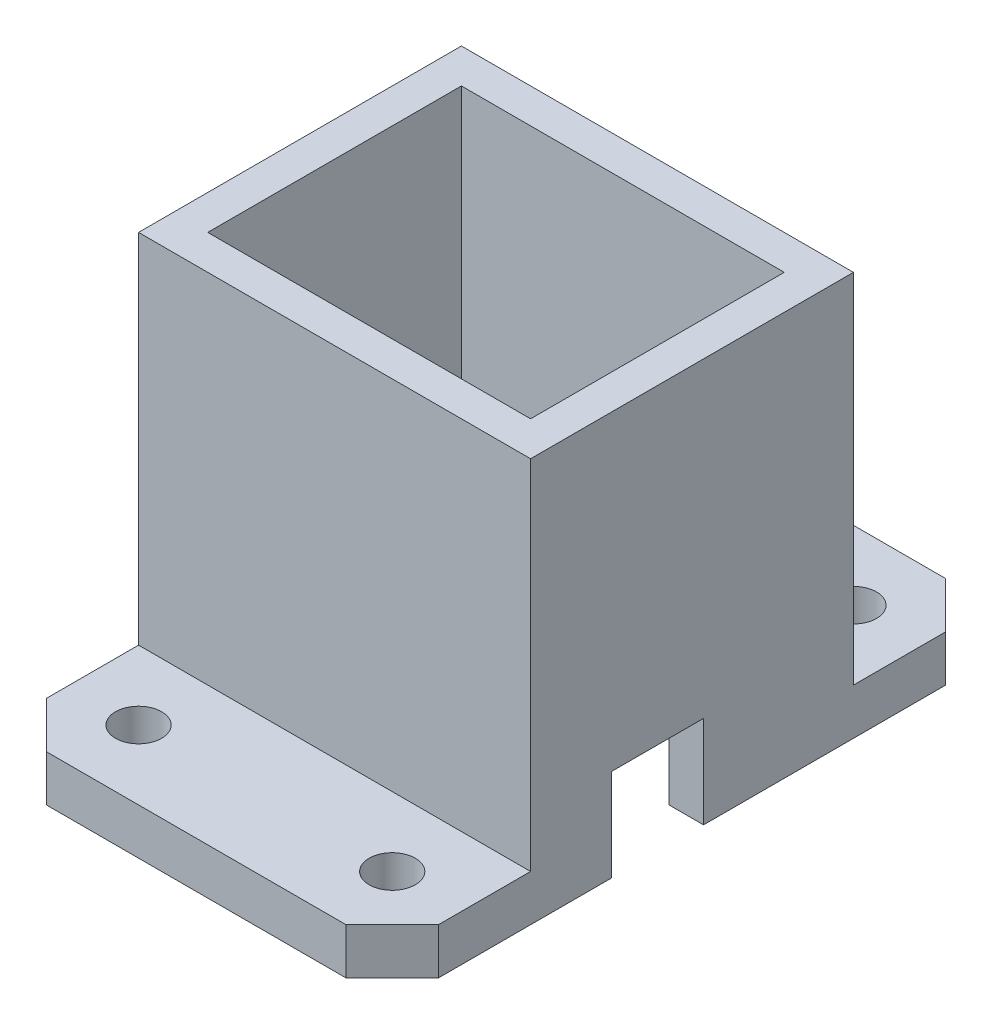
ISO-10303-21;
HEADER;
FILE_DESCRIPTION(('STEP AP214'),'2;1');
FILE_NAME('part.step','',(''),(''),'','','');
FILE_SCHEMA(('AUTOMOTIVE_DESIGN { 1 0 10303 214 1 1 1 1 }'));
ENDSEC;
DATA;
#1=APPLICATION_CONTEXT('core data for automotive mechanical design processes');
#2=APPLICATION_PROTOCOL_DEFINITION('international standard','automotive_design',2000,#1);
#3=PRODUCT_CONTEXT('',#1,'mechanical');
#4=PRODUCT('Part','Part','',(#3));
#5=PRODUCT_RELATED_PRODUCT_CATEGORY('part','',(#4));
#6=PRODUCT_DEFINITION_FORMATION('','',#4);
#7=PRODUCT_DEFINITION_CONTEXT('part definition',#1,'design');
#8=PRODUCT_DEFINITION('design','',#6,#7);
#9=PRODUCT_DEFINITION_SHAPE('','',#8);
#10=(LENGTH_UNIT() NAMED_UNIT(*) SI_UNIT(.MILLI.,.METRE.));
#11=(NAMED_UNIT(*) PLANE_ANGLE_UNIT() SI_UNIT($,.RADIAN.));
#12=(NAMED_UNIT(*) SI_UNIT($,.STERADIAN.) SOLID_ANGLE_UNIT());
#13=UNCERTAINTY_MEASURE_WITH_UNIT(LENGTH_MEASURE(1.E-05),#10,'distance_accuracy_value','');
#14=(GEOMETRIC_REPRESENTATION_CONTEXT(3) GLOBAL_UNCERTAINTY_ASSIGNED_CONTEXT((#13)) GLOBAL_UNIT_ASSIGNED_CONTEXT((#10,
#11,#12)) REPRESENTATION_CONTEXT('',''));
#15=CARTESIAN_POINT('',(0.,0.,0.));
#16=DIRECTION('',(0.,0.,1.));
#17=DIRECTION('',(1.,0.,0.));
#18=AXIS2_PLACEMENT_3D('',#15,#16,#17);
#19=CARTESIAN_POINT('',(-17.,35.,-14.));
#20=DIRECTION('',(0.,0.,1.));
#21=DIRECTION('',(1.,0.,0.));
#22=AXIS2_PLACEMENT_3D('',#19,#20,#21);
#23=PLANE('',#22);
#24=DIRECTION('',(1.,0.,0.));
#25=VECTOR('',#24,1.);
#26=CARTESIAN_POINT('',(17.,4.,-14.));
#27=LINE('',#26,#25);
#28=CARTESIAN_POINT('',(-17.,4.,-14.));
#29=VERTEX_POINT('',#28);
#30=CARTESIAN_POINT('',(17.,4.,-14.));
#31=VERTEX_POINT('',#30);
#32=EDGE_CURVE('E205',#29,#31,#27,.T.);
#33=ORIENTED_EDGE('',*,*,#32,.F.);
#34=DIRECTION('',(0.,-1.,0.));
#35=VECTOR('',#34,1.);
#36=CARTESIAN_POINT('',(-17.,35.,-14.));
#37=LINE('',#36,#35);
#38=CARTESIAN_POINT('',(-17.,35.,-14.));
#39=VERTEX_POINT('',#38);
#40=EDGE_CURVE('E210',#39,#29,#37,.T.);
#41=ORIENTED_EDGE('',*,*,#40,.F.);
#42=DIRECTION('',(-1.,0.,0.));
#43=VECTOR('',#42,1.);
#44=CARTESIAN_POINT('',(-17.,35.,-14.));
#45=LINE('',#44,#43);
#46=CARTESIAN_POINT('',(17.,35.,-14.));
#47=VERTEX_POINT('',#46);
#48=EDGE_CURVE('E207',#47,#39,#45,.T.);
#49=ORIENTED_EDGE('',*,*,#48,.F.);
#50=DIRECTION('',(0.,-1.,0.));
#51=VECTOR('',#50,1.);
#52=CARTESIAN_POINT('',(17.,35.,-14.));
#53=LINE('',#52,#51);
#54=EDGE_CURVE('E195',#47,#31,#53,.T.);
#55=ORIENTED_EDGE('',*,*,#54,.T.);
#56=EDGE_LOOP('',(#33,#41,#49,#55));
#57=FACE_BOUND('',#56,.T.);
#58=ADVANCED_FACE('F33',(#57),#23,.F.);
#59=CARTESIAN_POINT('',(-17.,35.,14.));
#60=DIRECTION('',(0.,0.,-1.));
#61=DIRECTION('',(-1.,0.,0.));
#62=AXIS2_PLACEMENT_3D('',#59,#60,#61);
#63=PLANE('',#62);
#64=DIRECTION('',(-1.,0.,0.));
#65=VECTOR('',#64,1.);
#66=CARTESIAN_POINT('',(-17.,4.,14.));
#67=LINE('',#66,#65);
#68=CARTESIAN_POINT('',(17.,4.,14.));
#69=VERTEX_POINT('',#68);
#70=CARTESIAN_POINT('',(-17.,4.,14.));
#71=VERTEX_POINT('',#70);
#72=EDGE_CURVE('E226',#69,#71,#67,.T.);
#73=ORIENTED_EDGE('',*,*,#72,.F.);
#74=DIRECTION('',(0.,-1.,0.));
#75=VECTOR('',#74,1.);
#76=CARTESIAN_POINT('',(17.,35.,14.));
#77=LINE('',#76,#75);
#78=CARTESIAN_POINT('',(17.,35.,14.));
#79=VERTEX_POINT('',#78);
#80=EDGE_CURVE('E320',#79,#69,#77,.T.);
#81=ORIENTED_EDGE('',*,*,#80,.F.);
#82=DIRECTION('',(1.,0.,0.));
#83=VECTOR('',#82,1.);
#84=CARTESIAN_POINT('',(-17.,35.,14.));
#85=LINE('',#84,#83);
#86=CARTESIAN_POINT('',(-17.,35.,14.));
#87=VERTEX_POINT('',#86);
#88=EDGE_CURVE('E318',#87,#79,#85,.T.);
#89=ORIENTED_EDGE('',*,*,#88,.F.);
#90=DIRECTION('',(0.,-1.,0.));
#91=VECTOR('',#90,1.);
#92=CARTESIAN_POINT('',(-17.,35.,14.));
#93=LINE('',#92,#91);
#94=EDGE_CURVE('E327',#87,#71,#93,.T.);
#95=ORIENTED_EDGE('',*,*,#94,.T.);
#96=EDGE_LOOP('',(#73,#81,#89,#95));
#97=FACE_BOUND('',#96,.T.);
#98=ADVANCED_FACE('F459',(#97),#63,.F.);
#99=CARTESIAN_POINT('',(0.,0.,0.));
#100=DIRECTION('',(0.,-1.,0.));
#101=DIRECTION('',(0.,0.,-1.));
#102=AXIS2_PLACEMENT_3D('',#99,#100,#101);
#103=PLANE('',#102);
#104=CARTESIAN_POINT('',(11.,0.,20.));
#105=DIRECTION('',(0.,1.,0.));
#106=DIRECTION('',(0.,0.,1.));
#107=AXIS2_PLACEMENT_3D('',#104,#105,#106);
#108=CIRCLE('',#107,2.);
#109=CARTESIAN_POINT('',(11.,0.,22.));
#110=VERTEX_POINT('',#109);
#111=EDGE_CURVE('E522',#110,#110,#108,.T.);
#112=ORIENTED_EDGE('',*,*,#111,.T.);
#113=EDGE_LOOP('',(#112));
#114=FACE_BOUND('',#113,.T.);
#115=CARTESIAN_POINT('',(-11.,0.,20.));
#116=DIRECTION('',(0.,1.,0.));
#117=DIRECTION('',(0.,0.,1.));
#118=AXIS2_PLACEMENT_3D('',#115,#116,#117);
#119=CIRCLE('',#118,2.);
#120=CARTESIAN_POINT('',(-11.,0.,22.));
#121=VERTEX_POINT('',#120);
#122=EDGE_CURVE('E216',#121,#121,#119,.T.);
#123=ORIENTED_EDGE('',*,*,#122,.T.);
#124=EDGE_LOOP('',(#123));
#125=FACE_BOUND('',#124,.T.);
#126=DIRECTION('',(1.,0.,0.));
#127=VECTOR('',#126,1.);
#128=CARTESIAN_POINT('',(-17.,0.,26.));
#129=LINE('',#128,#127);
#130=CARTESIAN_POINT('',(-13.,0.,26.));
#131=VERTEX_POINT('',#130);
#132=CARTESIAN_POINT('',(13.,0.,26.));
#133=VERTEX_POINT('',#132);
#134=EDGE_CURVE('E227',#131,#133,#129,.T.);
#135=ORIENTED_EDGE('',*,*,#134,.F.);
#136=DIRECTION('',(0.707106781186546,0.,0.707106781186549));
#137=VECTOR('',#136,1.);
#138=CARTESIAN_POINT('',(-19.5,0.,19.5));
#139=LINE('',#138,#137);
#140=CARTESIAN_POINT('',(-17.,0.,22.));
#141=VERTEX_POINT('',#140);
#142=EDGE_CURVE('E345',#131,#141,#139,.F.);
#143=ORIENTED_EDGE('',*,*,#142,.T.);
#144=DIRECTION('',(0.,0.,1.));
#145=VECTOR('',#144,1.);
#146=CARTESIAN_POINT('',(-17.,0.,14.));
#147=LINE('',#146,#145);
#148=CARTESIAN_POINT('',(-17.,0.,7.));
#149=VERTEX_POINT('',#148);
#150=EDGE_CURVE('E323',#149,#141,#147,.T.);
#151=ORIENTED_EDGE('',*,*,#150,.F.);
#152=DIRECTION('',(-1.,0.,0.));
#153=VECTOR('',#152,1.);
#154=CARTESIAN_POINT('',(18.,0.,7.));
#155=LINE('',#154,#153);
#156=CARTESIAN_POINT('',(-14.,0.,7.));
#157=VERTEX_POINT('',#156);
#158=EDGE_CURVE('E249',#157,#149,#155,.T.);
#159=ORIENTED_EDGE('',*,*,#158,.F.);
#160=DIRECTION('',(0.,0.,1.));
#161=VECTOR('',#160,1.);
#162=CARTESIAN_POINT('',(-14.,0.,11.));
#163=LINE('',#162,#161);
#164=CARTESIAN_POINT('',(-14.,0.,11.));
#165=VERTEX_POINT('',#164);
#166=EDGE_CURVE('E295',#157,#165,#163,.T.);
#167=ORIENTED_EDGE('',*,*,#166,.T.);
#168=DIRECTION('',(1.,0.,0.));
#169=VECTOR('',#168,1.);
#170=CARTESIAN_POINT('',(-14.,0.,11.));
#171=LINE('',#170,#169);
#172=CARTESIAN_POINT('',(14.,0.,11.));
#173=VERTEX_POINT('',#172);
#174=EDGE_CURVE('E281',#165,#173,#171,.T.);
#175=ORIENTED_EDGE('',*,*,#174,.T.);
#176=DIRECTION('',(0.,0.,-1.));
#177=VECTOR('',#176,1.);
#178=CARTESIAN_POINT('',(14.,0.,11.));
#179=LINE('',#178,#177);
#180=CARTESIAN_POINT('',(14.,0.,7.));
#181=VERTEX_POINT('',#180);
#182=EDGE_CURVE('E289',#173,#181,#179,.T.);
#183=ORIENTED_EDGE('',*,*,#182,.T.);
#184=CARTESIAN_POINT('',(17.,0.,7.));
#185=VERTEX_POINT('',#184);
#186=EDGE_CURVE('E251',#185,#181,#155,.T.);
#187=ORIENTED_EDGE('',*,*,#186,.F.);
#188=DIRECTION('',(0.,0.,-1.));
#189=VECTOR('',#188,1.);
#190=CARTESIAN_POINT('',(17.,0.,14.));
#191=LINE('',#190,#189);
#192=CARTESIAN_POINT('',(17.,0.,22.));
#193=VERTEX_POINT('',#192);
#194=EDGE_CURVE('E321',#193,#185,#191,.T.);
#195=ORIENTED_EDGE('',*,*,#194,.F.);
#196=DIRECTION('',(0.707106781186546,0.,-0.707106781186549));
#197=VECTOR('',#196,1.);
#198=CARTESIAN_POINT('',(19.5,0.,19.5));
#199=LINE('',#198,#197);
#200=EDGE_CURVE('E343',#193,#133,#199,.F.);
#201=ORIENTED_EDGE('',*,*,#200,.T.);
#202=EDGE_LOOP('',(#135,#143,#151,#159,#167,#175,#183,#187,#195,#201));
#203=FACE_BOUND('',#202,.T.);
#204=ADVANCED_FACE('F376',(#114,#125,#203),#103,.T.);
#205=CARTESIAN_POINT('',(0.,35.,0.));
#206=DIRECTION('',(0.,-1.,0.));
#207=DIRECTION('',(0.,0.,-1.));
#208=AXIS2_PLACEMENT_3D('',#205,#206,#207);
#209=PLANE('',#208);
#210=DIRECTION('',(0.,0.,-1.));
#211=VECTOR('',#210,1.);
#212=CARTESIAN_POINT('',(17.,35.,14.));
#213=LINE('',#212,#211);
#214=EDGE_CURVE('E312',#79,#47,#213,.T.);
#215=ORIENTED_EDGE('',*,*,#214,.T.);
#216=ORIENTED_EDGE('',*,*,#48,.T.);
#217=DIRECTION('',(0.,0.,1.));
#218=VECTOR('',#217,1.);
#219=CARTESIAN_POINT('',(-17.,35.,14.));
#220=LINE('',#219,#218);
#221=EDGE_CURVE('E316',#39,#87,#220,.T.);
#222=ORIENTED_EDGE('',*,*,#221,.T.);
#223=ORIENTED_EDGE('',*,*,#88,.T.);
#224=EDGE_LOOP('',(#215,#216,#222,#223));
#225=FACE_BOUND('',#224,.T.);
#226=DIRECTION('',(0.,0.,-1.));
#227=VECTOR('',#226,1.);
#228=CARTESIAN_POINT('',(14.,35.,11.));
#229=LINE('',#228,#227);
#230=CARTESIAN_POINT('',(14.,35.,11.));
#231=VERTEX_POINT('',#230);
#232=CARTESIAN_POINT('',(14.,35.,-11.));
#233=VERTEX_POINT('',#232);
#234=EDGE_CURVE('E278',#231,#233,#229,.T.);
#235=ORIENTED_EDGE('',*,*,#234,.F.);
#236=DIRECTION('',(1.,0.,0.));
#237=VECTOR('',#236,1.);
#238=CARTESIAN_POINT('',(-14.,35.,11.));
#239=LINE('',#238,#237);
#240=CARTESIAN_POINT('',(-14.,35.,11.));
#241=VERTEX_POINT('',#240);
#242=EDGE_CURVE('E286',#241,#231,#239,.T.);
#243=ORIENTED_EDGE('',*,*,#242,.F.);
#244=DIRECTION('',(0.,0.,1.));
#245=VECTOR('',#244,1.);
#246=CARTESIAN_POINT('',(-14.,35.,11.));
#247=LINE('',#246,#245);
#248=CARTESIAN_POINT('',(-14.,35.,-11.));
#249=VERTEX_POINT('',#248);
#250=EDGE_CURVE('E283',#249,#241,#247,.T.);
#251=ORIENTED_EDGE('',*,*,#250,.F.);
#252=DIRECTION('',(-1.,0.,0.));
#253=VECTOR('',#252,1.);
#254=CARTESIAN_POINT('',(-14.,35.,-11.));
#255=LINE('',#254,#253);
#256=EDGE_CURVE('E280',#233,#249,#255,.T.);
#257=ORIENTED_EDGE('',*,*,#256,.F.);
#258=EDGE_LOOP('',(#235,#243,#251,#257));
#259=FACE_BOUND('',#258,.T.);
#260=ADVANCED_FACE('F505',(#225,#259),#209,.F.);
#261=CARTESIAN_POINT('',(-11.,0.,-20.));
#262=DIRECTION('',(0.,1.,0.));
#263=DIRECTION('',(0.,0.,1.));
#264=AXIS2_PLACEMENT_3D('',#261,#262,#263);
#265=CIRCLE('',#264,2.);
#266=CARTESIAN_POINT('',(-11.,0.,-18.));
#267=VERTEX_POINT('',#266);
#268=EDGE_CURVE('E539',#267,#267,#265,.T.);
#269=ORIENTED_EDGE('',*,*,#268,.T.);
#270=EDGE_LOOP('',(#269));
#271=FACE_BOUND('',#270,.T.);
#272=CARTESIAN_POINT('',(11.,0.,-20.));
#273=DIRECTION('',(0.,1.,0.));
#274=DIRECTION('',(0.,0.,1.));
#275=AXIS2_PLACEMENT_3D('',#272,#273,#274);
#276=CIRCLE('',#275,2.);
#277=CARTESIAN_POINT('',(11.,0.,-18.));
#278=VERTEX_POINT('',#277);
#279=EDGE_CURVE('E540',#278,#278,#276,.T.);
#280=ORIENTED_EDGE('',*,*,#279,.T.);
#281=EDGE_LOOP('',(#280));
#282=FACE_BOUND('',#281,.T.);
#283=CARTESIAN_POINT('',(-17.,0.,-22.));
#284=VERTEX_POINT('',#283);
#285=CARTESIAN_POINT('',(-17.,0.,-0.999999999999999));
#286=VERTEX_POINT('',#285);
#287=EDGE_CURVE('E314',#284,#286,#147,.T.);
#288=ORIENTED_EDGE('',*,*,#287,.F.);
#289=DIRECTION('',(-0.707106781186546,0.,0.707106781186549));
#290=VECTOR('',#289,1.);
#291=CARTESIAN_POINT('',(-19.5,0.,-19.5));
#292=LINE('',#291,#290);
#293=CARTESIAN_POINT('',(-13.,0.,-26.));
#294=VERTEX_POINT('',#293);
#295=EDGE_CURVE('E366',#284,#294,#292,.F.);
#296=ORIENTED_EDGE('',*,*,#295,.T.);
#297=DIRECTION('',(-1.,0.,0.));
#298=VECTOR('',#297,1.);
#299=CARTESIAN_POINT('',(17.,0.,-26.));
#300=LINE('',#299,#298);
#301=CARTESIAN_POINT('',(13.,0.,-26.));
#302=VERTEX_POINT('',#301);
#303=EDGE_CURVE('E215',#302,#294,#300,.T.);
#304=ORIENTED_EDGE('',*,*,#303,.F.);
#305=DIRECTION('',(-0.707106781186546,0.,-0.707106781186549));
#306=VECTOR('',#305,1.);
#307=CARTESIAN_POINT('',(19.5,0.,-19.5));
#308=LINE('',#307,#306);
#309=CARTESIAN_POINT('',(17.,0.,-22.));
#310=VERTEX_POINT('',#309);
#311=EDGE_CURVE('E48',#302,#310,#308,.F.);
#312=ORIENTED_EDGE('',*,*,#311,.T.);
#313=CARTESIAN_POINT('',(17.,0.,-0.999999999999999));
#314=VERTEX_POINT('',#313);
#315=EDGE_CURVE('E311',#314,#310,#191,.T.);
#316=ORIENTED_EDGE('',*,*,#315,.F.);
#317=DIRECTION('',(-1.,0.,0.));
#318=VECTOR('',#317,1.);
#319=CARTESIAN_POINT('',(18.,0.,-0.999999999999999));
#320=LINE('',#319,#318);
#321=CARTESIAN_POINT('',(14.,0.,-0.999999999999999));
#322=VERTEX_POINT('',#321);
#323=EDGE_CURVE('E252',#314,#322,#320,.T.);
#324=ORIENTED_EDGE('',*,*,#323,.T.);
#325=CARTESIAN_POINT('',(14.,0.,-11.));
#326=VERTEX_POINT('',#325);
#327=EDGE_CURVE('E277',#322,#326,#179,.T.);
#328=ORIENTED_EDGE('',*,*,#327,.T.);
#329=DIRECTION('',(-1.,0.,0.));
#330=VECTOR('',#329,1.);
#331=CARTESIAN_POINT('',(-14.,0.,-11.));
#332=LINE('',#331,#330);
#333=CARTESIAN_POINT('',(-14.,0.,-11.));
#334=VERTEX_POINT('',#333);
#335=EDGE_CURVE('E292',#326,#334,#332,.T.);
#336=ORIENTED_EDGE('',*,*,#335,.T.);
#337=CARTESIAN_POINT('',(-14.,0.,-0.999999999999999));
#338=VERTEX_POINT('',#337);
#339=EDGE_CURVE('E296',#334,#338,#163,.T.);
#340=ORIENTED_EDGE('',*,*,#339,.T.);
#341=EDGE_CURVE('E253',#338,#286,#320,.T.);
#342=ORIENTED_EDGE('',*,*,#341,.T.);
#343=EDGE_LOOP('',(#288,#296,#304,#312,#316,#324,#328,#336,#340,#342));
#344=FACE_BOUND('',#343,.T.);
#345=ADVANCED_FACE('F432',(#271,#282,#344),#103,.T.);
#346=CARTESIAN_POINT('',(17.,35.,14.));
#347=DIRECTION('',(-1.,0.,0.));
#348=DIRECTION('',(0.,0.,1.));
#349=AXIS2_PLACEMENT_3D('',#346,#347,#348);
#350=PLANE('',#349);
#351=ORIENTED_EDGE('',*,*,#315,.T.);
#352=DIRECTION('',(0.,1.,0.));
#353=VECTOR('',#352,1.);
#354=CARTESIAN_POINT('',(17.,35.,-22.));
#355=LINE('',#354,#353);
#356=CARTESIAN_POINT('',(17.,4.,-22.));
#357=VERTEX_POINT('',#356);
#358=EDGE_CURVE('E11',#310,#357,#355,.T.);
#359=ORIENTED_EDGE('',*,*,#358,.T.);
#360=DIRECTION('',(0.,0.,1.));
#361=VECTOR('',#360,1.);
#362=CARTESIAN_POINT('',(17.,4.,-26.));
#363=LINE('',#362,#361);
#364=EDGE_CURVE('E191',#357,#31,#363,.T.);
#365=ORIENTED_EDGE('',*,*,#364,.T.);
#366=ORIENTED_EDGE('',*,*,#54,.F.);
#367=ORIENTED_EDGE('',*,*,#214,.F.);
#368=ORIENTED_EDGE('',*,*,#80,.T.);
#369=DIRECTION('',(0.,0.,-1.));
#370=VECTOR('',#369,1.);
#371=CARTESIAN_POINT('',(17.,4.,26.));
#372=LINE('',#371,#370);
#373=CARTESIAN_POINT('',(17.,4.,22.));
#374=VERTEX_POINT('',#373);
#375=EDGE_CURVE('E237',#374,#69,#372,.T.);
#376=ORIENTED_EDGE('',*,*,#375,.F.);
#377=DIRECTION('',(0.,-1.,0.));
#378=VECTOR('',#377,1.);
#379=CARTESIAN_POINT('',(17.,35.,22.));
#380=LINE('',#379,#378);
#381=EDGE_CURVE('E41',#374,#193,#380,.T.);
#382=ORIENTED_EDGE('',*,*,#381,.T.);
#383=ORIENTED_EDGE('',*,*,#194,.T.);
#384=DIRECTION('',(0.,1.,0.));
#385=VECTOR('',#384,1.);
#386=CARTESIAN_POINT('',(17.,35.,7.));
#387=LINE('',#386,#385);
#388=CARTESIAN_POINT('',(17.,8.,7.));
#389=VERTEX_POINT('',#388);
#390=EDGE_CURVE('E274',#185,#389,#387,.T.);
#391=ORIENTED_EDGE('',*,*,#390,.T.);
#392=DIRECTION('',(0.,0.,-1.));
#393=VECTOR('',#392,1.);
#394=CARTESIAN_POINT('',(17.,8.,14.));
#395=LINE('',#394,#393);
#396=CARTESIAN_POINT('',(17.,8.,-0.999999999999999));
#397=VERTEX_POINT('',#396);
#398=EDGE_CURVE('E263',#389,#397,#395,.T.);
#399=ORIENTED_EDGE('',*,*,#398,.T.);
#400=DIRECTION('',(0.,-1.,0.));
#401=VECTOR('',#400,1.);
#402=CARTESIAN_POINT('',(17.,35.,-0.999999999999999));
#403=LINE('',#402,#401);
#404=EDGE_CURVE('E268',#397,#314,#403,.T.);
#405=ORIENTED_EDGE('',*,*,#404,.T.);
#406=EDGE_LOOP('',(#351,#359,#365,#366,#367,#368,#376,#382,#383,#391,#399,#405));
#407=FACE_BOUND('',#406,.T.);
#408=ADVANCED_FACE('F193',(#407),#350,.F.);
#409=CARTESIAN_POINT('',(-17.,35.,14.));
#410=DIRECTION('',(1.,0.,0.));
#411=DIRECTION('',(0.,0.,-1.));
#412=AXIS2_PLACEMENT_3D('',#409,#410,#411);
#413=PLANE('',#412);
#414=ORIENTED_EDGE('',*,*,#150,.T.);
#415=DIRECTION('',(0.,1.,0.));
#416=VECTOR('',#415,1.);
#417=CARTESIAN_POINT('',(-17.,35.,22.));
#418=LINE('',#417,#416);
#419=CARTESIAN_POINT('',(-17.,4.,22.));
#420=VERTEX_POINT('',#419);
#421=EDGE_CURVE('E349',#141,#420,#418,.T.);
#422=ORIENTED_EDGE('',*,*,#421,.T.);
#423=DIRECTION('',(0.,0.,-1.));
#424=VECTOR('',#423,1.);
#425=CARTESIAN_POINT('',(-17.,4.,26.));
#426=LINE('',#425,#424);
#427=EDGE_CURVE('E233',#420,#71,#426,.T.);
#428=ORIENTED_EDGE('',*,*,#427,.T.);
#429=ORIENTED_EDGE('',*,*,#94,.F.);
#430=ORIENTED_EDGE('',*,*,#221,.F.);
#431=ORIENTED_EDGE('',*,*,#40,.T.);
#432=DIRECTION('',(0.,0.,1.));
#433=VECTOR('',#432,1.);
#434=CARTESIAN_POINT('',(-17.,4.,-26.));
#435=LINE('',#434,#433);
#436=CARTESIAN_POINT('',(-17.,4.,-22.));
#437=VERTEX_POINT('',#436);
#438=EDGE_CURVE('E199',#437,#29,#435,.T.);
#439=ORIENTED_EDGE('',*,*,#438,.F.);
#440=DIRECTION('',(0.,-1.,0.));
#441=VECTOR('',#440,1.);
#442=CARTESIAN_POINT('',(-17.,35.,-22.));
#443=LINE('',#442,#441);
#444=EDGE_CURVE('E347',#437,#284,#443,.T.);
#445=ORIENTED_EDGE('',*,*,#444,.T.);
#446=ORIENTED_EDGE('',*,*,#287,.T.);
#447=DIRECTION('',(0.,-1.,0.));
#448=VECTOR('',#447,1.);
#449=CARTESIAN_POINT('',(-17.,0.,-0.999999999999999));
#450=LINE('',#449,#448);
#451=CARTESIAN_POINT('',(-17.,8.,-0.999999999999999));
#452=VERTEX_POINT('',#451);
#453=EDGE_CURVE('E245',#452,#286,#450,.T.);
#454=ORIENTED_EDGE('',*,*,#453,.F.);
#455=DIRECTION('',(0.,0.,-1.));
#456=VECTOR('',#455,1.);
#457=CARTESIAN_POINT('',(-17.,8.,7.));
#458=LINE('',#457,#456);
#459=CARTESIAN_POINT('',(-17.,8.,7.));
#460=VERTEX_POINT('',#459);
#461=EDGE_CURVE('E242',#460,#452,#458,.T.);
#462=ORIENTED_EDGE('',*,*,#461,.F.);
#463=DIRECTION('',(0.,1.,0.));
#464=VECTOR('',#463,1.);
#465=CARTESIAN_POINT('',(-17.,0.,7.));
#466=LINE('',#465,#464);
#467=EDGE_CURVE('E239',#149,#460,#466,.T.);
#468=ORIENTED_EDGE('',*,*,#467,.F.);
#469=EDGE_LOOP('',(#414,#422,#428,#429,#430,#431,#439,#445,#446,#454,#462,#468));
#470=FACE_BOUND('',#469,.T.);
#471=ADVANCED_FACE('F394',(#470),#413,.F.);
#472=CARTESIAN_POINT('',(14.,35.,11.));
#473=DIRECTION('',(-1.,0.,0.));
#474=DIRECTION('',(0.,0.,1.));
#475=AXIS2_PLACEMENT_3D('',#472,#473,#474);
#476=PLANE('',#475);
#477=DIRECTION('',(0.,1.,0.));
#478=VECTOR('',#477,1.);
#479=CARTESIAN_POINT('',(14.,35.,7.));
#480=LINE('',#479,#478);
#481=CARTESIAN_POINT('',(14.,8.,7.));
#482=VERTEX_POINT('',#481);
#483=EDGE_CURVE('E271',#181,#482,#480,.T.);
#484=ORIENTED_EDGE('',*,*,#483,.F.);
#485=ORIENTED_EDGE('',*,*,#182,.F.);
#486=DIRECTION('',(0.,-1.,0.));
#487=VECTOR('',#486,1.);
#488=CARTESIAN_POINT('',(14.,35.,11.));
#489=LINE('',#488,#487);
#490=EDGE_CURVE('E288',#231,#173,#489,.T.);
#491=ORIENTED_EDGE('',*,*,#490,.F.);
#492=ORIENTED_EDGE('',*,*,#234,.T.);
#493=DIRECTION('',(0.,-1.,0.));
#494=VECTOR('',#493,1.);
#495=CARTESIAN_POINT('',(14.,35.,-11.));
#496=LINE('',#495,#494);
#497=EDGE_CURVE('E308',#233,#326,#496,.T.);
#498=ORIENTED_EDGE('',*,*,#497,.T.);
#499=ORIENTED_EDGE('',*,*,#327,.F.);
#500=DIRECTION('',(0.,-1.,0.));
#501=VECTOR('',#500,1.);
#502=CARTESIAN_POINT('',(14.,35.,-0.999999999999999));
#503=LINE('',#502,#501);
#504=CARTESIAN_POINT('',(14.,8.,-0.999999999999999));
#505=VERTEX_POINT('',#504);
#506=EDGE_CURVE('E266',#505,#322,#503,.T.);
#507=ORIENTED_EDGE('',*,*,#506,.F.);
#508=DIRECTION('',(0.,0.,-1.));
#509=VECTOR('',#508,1.);
#510=CARTESIAN_POINT('',(14.,8.,11.));
#511=LINE('',#510,#509);
#512=EDGE_CURVE('E261',#482,#505,#511,.T.);
#513=ORIENTED_EDGE('',*,*,#512,.F.);
#514=EDGE_LOOP('',(#484,#485,#491,#492,#498,#499,#507,#513));
#515=FACE_BOUND('',#514,.T.);
#516=ADVANCED_FACE('F414',(#515),#476,.T.);
#517=CARTESIAN_POINT('',(-14.,35.,-11.));
#518=DIRECTION('',(0.,0.,1.));
#519=DIRECTION('',(1.,0.,0.));
#520=AXIS2_PLACEMENT_3D('',#517,#518,#519);
#521=PLANE('',#520);
#522=ORIENTED_EDGE('',*,*,#335,.F.);
#523=ORIENTED_EDGE('',*,*,#497,.F.);
#524=ORIENTED_EDGE('',*,*,#256,.T.);
#525=DIRECTION('',(0.,-1.,0.));
#526=VECTOR('',#525,1.);
#527=CARTESIAN_POINT('',(-14.,35.,-11.));
#528=LINE('',#527,#526);
#529=EDGE_CURVE('E306',#249,#334,#528,.T.);
#530=ORIENTED_EDGE('',*,*,#529,.T.);
#531=EDGE_LOOP('',(#522,#523,#524,#530));
#532=FACE_BOUND('',#531,.T.);
#533=ADVANCED_FACE('F434',(#532),#521,.T.);
#534=CARTESIAN_POINT('',(-14.,35.,11.));
#535=DIRECTION('',(1.,0.,0.));
#536=DIRECTION('',(0.,0.,-1.));
#537=AXIS2_PLACEMENT_3D('',#534,#535,#536);
#538=PLANE('',#537);
#539=DIRECTION('',(0.,-1.,0.));
#540=VECTOR('',#539,1.);
#541=CARTESIAN_POINT('',(-14.,35.,7.));
#542=LINE('',#541,#540);
#543=CARTESIAN_POINT('',(-14.,8.,7.));
#544=VERTEX_POINT('',#543);
#545=EDGE_CURVE('E335',#544,#157,#542,.T.);
#546=ORIENTED_EDGE('',*,*,#545,.F.);
#547=DIRECTION('',(0.,0.,1.));
#548=VECTOR('',#547,1.);
#549=CARTESIAN_POINT('',(-14.,8.,11.));
#550=LINE('',#549,#548);
#551=CARTESIAN_POINT('',(-14.,7.99999999999999,-0.999999999999999));
#552=VERTEX_POINT('',#551);
#553=EDGE_CURVE('E209',#552,#544,#550,.T.);
#554=ORIENTED_EDGE('',*,*,#553,.F.);
#555=DIRECTION('',(0.,1.,0.));
#556=VECTOR('',#555,1.);
#557=CARTESIAN_POINT('',(-14.,35.,-0.999999999999999));
#558=LINE('',#557,#556);
#559=EDGE_CURVE('E332',#338,#552,#558,.T.);
#560=ORIENTED_EDGE('',*,*,#559,.F.);
#561=ORIENTED_EDGE('',*,*,#339,.F.);
#562=ORIENTED_EDGE('',*,*,#529,.F.);
#563=ORIENTED_EDGE('',*,*,#250,.T.);
#564=DIRECTION('',(0.,-1.,0.));
#565=VECTOR('',#564,1.);
#566=CARTESIAN_POINT('',(-14.,35.,11.));
#567=LINE('',#566,#565);
#568=EDGE_CURVE('E303',#241,#165,#567,.T.);
#569=ORIENTED_EDGE('',*,*,#568,.T.);
#570=ORIENTED_EDGE('',*,*,#166,.F.);
#571=EDGE_LOOP('',(#546,#554,#560,#561,#562,#563,#569,#570));
#572=FACE_BOUND('',#571,.T.);
#573=ADVANCED_FACE('F403',(#572),#538,.T.);
#574=CARTESIAN_POINT('',(-14.,35.,11.));
#575=DIRECTION('',(0.,0.,-1.));
#576=DIRECTION('',(-1.,0.,0.));
#577=AXIS2_PLACEMENT_3D('',#574,#575,#576);
#578=PLANE('',#577);
#579=ORIENTED_EDGE('',*,*,#174,.F.);
#580=ORIENTED_EDGE('',*,*,#568,.F.);
#581=ORIENTED_EDGE('',*,*,#242,.T.);
#582=ORIENTED_EDGE('',*,*,#490,.T.);
#583=EDGE_LOOP('',(#579,#580,#581,#582));
#584=FACE_BOUND('',#583,.T.);
#585=ADVANCED_FACE('F410',(#584),#578,.T.);
#586=CARTESIAN_POINT('',(18.,8.,7.));
#587=DIRECTION('',(0.,1.,0.));
#588=DIRECTION('',(0.,0.,1.));
#589=AXIS2_PLACEMENT_3D('',#586,#587,#588);
#590=PLANE('',#589);
#591=ORIENTED_EDGE('',*,*,#553,.T.);
#592=DIRECTION('',(-1.,0.,0.));
#593=VECTOR('',#592,1.);
#594=CARTESIAN_POINT('',(18.,8.,7.));
#595=LINE('',#594,#593);
#596=EDGE_CURVE('E248',#544,#460,#595,.T.);
#597=ORIENTED_EDGE('',*,*,#596,.T.);
#598=ORIENTED_EDGE('',*,*,#461,.T.);
#599=DIRECTION('',(-1.,0.,0.));
#600=VECTOR('',#599,1.);
#601=CARTESIAN_POINT('',(18.,8.,-0.999999999999999));
#602=LINE('',#601,#600);
#603=EDGE_CURVE('E257',#552,#452,#602,.T.);
#604=ORIENTED_EDGE('',*,*,#603,.F.);
#605=EDGE_LOOP('',(#591,#597,#598,#604));
#606=FACE_BOUND('',#605,.T.);
#607=ADVANCED_FACE('F491',(#606),#590,.F.);
#608=CARTESIAN_POINT('',(18.,0.,-0.999999999999999));
#609=DIRECTION('',(0.,0.,-1.));
#610=DIRECTION('',(-1.,0.,0.));
#611=AXIS2_PLACEMENT_3D('',#608,#609,#610);
#612=PLANE('',#611);
#613=ORIENTED_EDGE('',*,*,#559,.T.);
#614=ORIENTED_EDGE('',*,*,#603,.T.);
#615=ORIENTED_EDGE('',*,*,#453,.T.);
#616=ORIENTED_EDGE('',*,*,#341,.F.);
#617=EDGE_LOOP('',(#613,#614,#615,#616));
#618=FACE_BOUND('',#617,.T.);
#619=ADVANCED_FACE('F440',(#618),#612,.F.);
#620=CARTESIAN_POINT('',(18.,0.,7.));
#621=DIRECTION('',(0.,0.,1.));
#622=DIRECTION('',(1.,0.,0.));
#623=AXIS2_PLACEMENT_3D('',#620,#621,#622);
#624=PLANE('',#623);
#625=ORIENTED_EDGE('',*,*,#545,.T.);
#626=ORIENTED_EDGE('',*,*,#158,.T.);
#627=ORIENTED_EDGE('',*,*,#467,.T.);
#628=ORIENTED_EDGE('',*,*,#596,.F.);
#629=EDGE_LOOP('',(#625,#626,#627,#628));
#630=FACE_BOUND('',#629,.T.);
#631=ADVANCED_FACE('F399',(#630),#624,.F.);
#632=ORIENTED_EDGE('',*,*,#186,.T.);
#633=ORIENTED_EDGE('',*,*,#483,.T.);
#634=EDGE_CURVE('E259',#389,#482,#595,.T.);
#635=ORIENTED_EDGE('',*,*,#634,.F.);
#636=ORIENTED_EDGE('',*,*,#390,.F.);
#637=EDGE_LOOP('',(#632,#633,#635,#636));
#638=FACE_BOUND('',#637,.T.);
#639=ADVANCED_FACE('F420',(#638),#624,.F.);
#640=EDGE_CURVE('E256',#397,#505,#602,.T.);
#641=ORIENTED_EDGE('',*,*,#640,.T.);
#642=ORIENTED_EDGE('',*,*,#506,.T.);
#643=ORIENTED_EDGE('',*,*,#323,.F.);
#644=ORIENTED_EDGE('',*,*,#404,.F.);
#645=EDGE_LOOP('',(#641,#642,#643,#644));
#646=FACE_BOUND('',#645,.T.);
#647=ADVANCED_FACE('F426',(#646),#612,.F.);
#648=ORIENTED_EDGE('',*,*,#634,.T.);
#649=ORIENTED_EDGE('',*,*,#512,.T.);
#650=ORIENTED_EDGE('',*,*,#640,.F.);
#651=ORIENTED_EDGE('',*,*,#398,.F.);
#652=EDGE_LOOP('',(#648,#649,#650,#651));
#653=FACE_BOUND('',#652,.T.);
#654=ADVANCED_FACE('F423',(#653),#590,.F.);
#655=CARTESIAN_POINT('',(-17.,4.,26.));
#656=DIRECTION('',(0.,-1.,0.));
#657=DIRECTION('',(0.,0.,-1.));
#658=AXIS2_PLACEMENT_3D('',#655,#656,#657);
#659=PLANE('',#658);
#660=CARTESIAN_POINT('',(11.,4.,20.));
#661=DIRECTION('',(0.,1.,0.));
#662=DIRECTION('',(0.,0.,1.));
#663=AXIS2_PLACEMENT_3D('',#660,#661,#662);
#664=CIRCLE('',#663,2.);
#665=CARTESIAN_POINT('',(11.,4.,22.));
#666=VERTEX_POINT('',#665);
#667=EDGE_CURVE('E533',#666,#666,#664,.T.);
#668=ORIENTED_EDGE('',*,*,#667,.F.);
#669=EDGE_LOOP('',(#668));
#670=FACE_BOUND('',#669,.T.);
#671=CARTESIAN_POINT('',(-11.,4.,20.));
#672=DIRECTION('',(0.,1.,0.));
#673=DIRECTION('',(0.,0.,1.));
#674=AXIS2_PLACEMENT_3D('',#671,#672,#673);
#675=CIRCLE('',#674,2.);
#676=CARTESIAN_POINT('',(-11.,4.,22.));
#677=VERTEX_POINT('',#676);
#678=EDGE_CURVE('E221',#677,#677,#675,.T.);
#679=ORIENTED_EDGE('',*,*,#678,.F.);
#680=EDGE_LOOP('',(#679));
#681=FACE_BOUND('',#680,.T.);
#682=ORIENTED_EDGE('',*,*,#427,.F.);
#683=DIRECTION('',(-0.707106781186546,0.,-0.707106781186549));
#684=VECTOR('',#683,1.);
#685=CARTESIAN_POINT('',(-13.,4.,26.));
#686=LINE('',#685,#684);
#687=CARTESIAN_POINT('',(-13.,4.,26.));
#688=VERTEX_POINT('',#687);
#689=EDGE_CURVE('E353',#420,#688,#686,.F.);
#690=ORIENTED_EDGE('',*,*,#689,.T.);
#691=DIRECTION('',(-1.,0.,0.));
#692=VECTOR('',#691,1.);
#693=CARTESIAN_POINT('',(-17.,4.,26.));
#694=LINE('',#693,#692);
#695=CARTESIAN_POINT('',(13.,4.,26.));
#696=VERTEX_POINT('',#695);
#697=EDGE_CURVE('E230',#696,#688,#694,.T.);
#698=ORIENTED_EDGE('',*,*,#697,.F.);
#699=DIRECTION('',(-0.707106781186546,0.,0.707106781186549));
#700=VECTOR('',#699,1.);
#701=CARTESIAN_POINT('',(13.,4.,26.));
#702=LINE('',#701,#700);
#703=EDGE_CURVE('E351',#696,#374,#702,.F.);
#704=ORIENTED_EDGE('',*,*,#703,.T.);
#705=ORIENTED_EDGE('',*,*,#375,.T.);
#706=ORIENTED_EDGE('',*,*,#72,.T.);
#707=EDGE_LOOP('',(#682,#690,#698,#704,#705,#706));
#708=FACE_BOUND('',#707,.T.);
#709=ADVANCED_FACE('F384',(#670,#681,#708),#659,.F.);
#710=CARTESIAN_POINT('',(0.,0.,26.));
#711=DIRECTION('',(0.,0.,-1.));
#712=DIRECTION('',(-1.,0.,0.));
#713=AXIS2_PLACEMENT_3D('',#710,#711,#712);
#714=PLANE('',#713);
#715=ORIENTED_EDGE('',*,*,#697,.T.);
#716=DIRECTION('',(0.,-1.,0.));
#717=VECTOR('',#716,1.);
#718=CARTESIAN_POINT('',(-13.,0.,26.));
#719=LINE('',#718,#717);
#720=EDGE_CURVE('E340',#688,#131,#719,.T.);
#721=ORIENTED_EDGE('',*,*,#720,.T.);
#722=ORIENTED_EDGE('',*,*,#134,.T.);
#723=DIRECTION('',(0.,1.,0.));
#724=VECTOR('',#723,1.);
#725=CARTESIAN_POINT('',(13.,0.,26.));
#726=LINE('',#725,#724);
#727=EDGE_CURVE('E337',#133,#696,#726,.T.);
#728=ORIENTED_EDGE('',*,*,#727,.T.);
#729=EDGE_LOOP('',(#715,#721,#722,#728));
#730=FACE_BOUND('',#729,.T.);
#731=ADVANCED_FACE('F380',(#730),#714,.F.);
#732=CARTESIAN_POINT('',(17.,4.,-26.));
#733=DIRECTION('',(0.,-1.,0.));
#734=DIRECTION('',(0.,0.,-1.));
#735=AXIS2_PLACEMENT_3D('',#732,#733,#734);
#736=PLANE('',#735);
#737=CARTESIAN_POINT('',(-11.,4.,-20.));
#738=DIRECTION('',(0.,1.,0.));
#739=DIRECTION('',(0.,0.,1.));
#740=AXIS2_PLACEMENT_3D('',#737,#738,#739);
#741=CIRCLE('',#740,2.);
#742=CARTESIAN_POINT('',(-11.,4.,-18.));
#743=VERTEX_POINT('',#742);
#744=EDGE_CURVE('E536',#743,#743,#741,.T.);
#745=ORIENTED_EDGE('',*,*,#744,.F.);
#746=EDGE_LOOP('',(#745));
#747=FACE_BOUND('',#746,.T.);
#748=CARTESIAN_POINT('',(11.,4.,-20.));
#749=DIRECTION('',(0.,1.,0.));
#750=DIRECTION('',(0.,0.,1.));
#751=AXIS2_PLACEMENT_3D('',#748,#749,#750);
#752=CIRCLE('',#751,2.);
#753=CARTESIAN_POINT('',(11.,4.,-18.));
#754=VERTEX_POINT('',#753);
#755=EDGE_CURVE('E544',#754,#754,#752,.T.);
#756=ORIENTED_EDGE('',*,*,#755,.F.);
#757=EDGE_LOOP('',(#756));
#758=FACE_BOUND('',#757,.T.);
#759=DIRECTION('',(1.,0.,0.));
#760=VECTOR('',#759,1.);
#761=CARTESIAN_POINT('',(17.,4.,-26.));
#762=LINE('',#761,#760);
#763=CARTESIAN_POINT('',(-13.,4.,-26.));
#764=VERTEX_POINT('',#763);
#765=CARTESIAN_POINT('',(13.,4.,-26.));
#766=VERTEX_POINT('',#765);
#767=EDGE_CURVE('E200',#764,#766,#762,.T.);
#768=ORIENTED_EDGE('',*,*,#767,.F.);
#769=DIRECTION('',(0.707106781186546,0.,-0.707106781186549));
#770=VECTOR('',#769,1.);
#771=CARTESIAN_POINT('',(-13.,4.,-26.));
#772=LINE('',#771,#770);
#773=EDGE_CURVE('E363',#764,#437,#772,.F.);
#774=ORIENTED_EDGE('',*,*,#773,.T.);
#775=ORIENTED_EDGE('',*,*,#438,.T.);
#776=ORIENTED_EDGE('',*,*,#32,.T.);
#777=ORIENTED_EDGE('',*,*,#364,.F.);
#778=DIRECTION('',(0.707106781186546,0.,0.707106781186549));
#779=VECTOR('',#778,1.);
#780=CARTESIAN_POINT('',(13.,4.,-26.));
#781=LINE('',#780,#779);
#782=EDGE_CURVE('E361',#357,#766,#781,.F.);
#783=ORIENTED_EDGE('',*,*,#782,.T.);
#784=EDGE_LOOP('',(#768,#774,#775,#776,#777,#783));
#785=FACE_BOUND('',#784,.T.);
#786=ADVANCED_FACE('F213',(#747,#758,#785),#736,.F.);
#787=CARTESIAN_POINT('',(0.,0.,-26.));
#788=DIRECTION('',(0.,0.,1.));
#789=DIRECTION('',(1.,0.,0.));
#790=AXIS2_PLACEMENT_3D('',#787,#788,#789);
#791=PLANE('',#790);
#792=ORIENTED_EDGE('',*,*,#303,.T.);
#793=DIRECTION('',(0.,1.,0.));
#794=VECTOR('',#793,1.);
#795=CARTESIAN_POINT('',(-13.,0.,-26.));
#796=LINE('',#795,#794);
#797=EDGE_CURVE('E358',#294,#764,#796,.T.);
#798=ORIENTED_EDGE('',*,*,#797,.T.);
#799=ORIENTED_EDGE('',*,*,#767,.T.);
#800=DIRECTION('',(0.,-1.,0.));
#801=VECTOR('',#800,1.);
#802=CARTESIAN_POINT('',(13.,0.,-26.));
#803=LINE('',#802,#801);
#804=EDGE_CURVE('E355',#766,#302,#803,.T.);
#805=ORIENTED_EDGE('',*,*,#804,.T.);
#806=EDGE_LOOP('',(#792,#798,#799,#805));
#807=FACE_BOUND('',#806,.T.);
#808=ADVANCED_FACE('F446',(#807),#791,.F.);
#809=CARTESIAN_POINT('',(-13.,0.,26.));
#810=DIRECTION('',(0.707106781186549,0.,-0.707106781186546));
#811=DIRECTION('',(0.,-1.,0.));
#812=AXIS2_PLACEMENT_3D('',#809,#810,#811);
#813=PLANE('',#812);
#814=ORIENTED_EDGE('',*,*,#689,.F.);
#815=ORIENTED_EDGE('',*,*,#421,.F.);
#816=ORIENTED_EDGE('',*,*,#142,.F.);
#817=ORIENTED_EDGE('',*,*,#720,.F.);
#818=EDGE_LOOP('',(#814,#815,#816,#817));
#819=FACE_BOUND('',#818,.T.);
#820=ADVANCED_FACE('F388',(#819),#813,.F.);
#821=CARTESIAN_POINT('',(-13.,0.,-26.));
#822=DIRECTION('',(0.707106781186549,0.,0.707106781186546));
#823=DIRECTION('',(0.,1.,0.));
#824=AXIS2_PLACEMENT_3D('',#821,#822,#823);
#825=PLANE('',#824);
#826=ORIENTED_EDGE('',*,*,#295,.F.);
#827=ORIENTED_EDGE('',*,*,#444,.F.);
#828=ORIENTED_EDGE('',*,*,#773,.F.);
#829=ORIENTED_EDGE('',*,*,#797,.F.);
#830=EDGE_LOOP('',(#826,#827,#828,#829));
#831=FACE_BOUND('',#830,.T.);
#832=ADVANCED_FACE('F443',(#831),#825,.F.);
#833=CARTESIAN_POINT('',(13.,0.,-26.));
#834=DIRECTION('',(-0.707106781186549,0.,0.707106781186546));
#835=DIRECTION('',(0.,-1.,0.));
#836=AXIS2_PLACEMENT_3D('',#833,#834,#835);
#837=PLANE('',#836);
#838=ORIENTED_EDGE('',*,*,#782,.F.);
#839=ORIENTED_EDGE('',*,*,#358,.F.);
#840=ORIENTED_EDGE('',*,*,#311,.F.);
#841=ORIENTED_EDGE('',*,*,#804,.F.);
#842=EDGE_LOOP('',(#838,#839,#840,#841));
#843=FACE_BOUND('',#842,.T.);
#844=ADVANCED_FACE('F450',(#843),#837,.F.);
#845=CARTESIAN_POINT('',(13.,0.,26.));
#846=DIRECTION('',(-0.707106781186549,0.,-0.707106781186546));
#847=DIRECTION('',(0.,1.,0.));
#848=AXIS2_PLACEMENT_3D('',#845,#846,#847);
#849=PLANE('',#848);
#850=ORIENTED_EDGE('',*,*,#200,.F.);
#851=ORIENTED_EDGE('',*,*,#381,.F.);
#852=ORIENTED_EDGE('',*,*,#703,.F.);
#853=ORIENTED_EDGE('',*,*,#727,.F.);
#854=EDGE_LOOP('',(#850,#851,#852,#853));
#855=FACE_BOUND('',#854,.T.);
#856=ADVANCED_FACE('F35',(#855),#849,.F.);
#857=CARTESIAN_POINT('',(11.,0.,-20.));
#858=DIRECTION('',(0.,1.,0.));
#859=DIRECTION('',(0.,0.,1.));
#860=AXIS2_PLACEMENT_3D('',#857,#858,#859);
#861=CYLINDRICAL_SURFACE('',#860,2.);
#862=ORIENTED_EDGE('',*,*,#279,.F.);
#863=EDGE_LOOP('',(#862));
#864=FACE_BOUND('',#863,.T.);
#865=ORIENTED_EDGE('',*,*,#755,.T.);
#866=EDGE_LOOP('',(#865));
#867=FACE_BOUND('',#866,.T.);
#868=ADVANCED_FACE('F456',(#864,#867),#861,.F.);
#869=CARTESIAN_POINT('',(-11.,0.,-20.));
#870=DIRECTION('',(0.,1.,0.));
#871=DIRECTION('',(0.,0.,1.));
#872=AXIS2_PLACEMENT_3D('',#869,#870,#871);
#873=CYLINDRICAL_SURFACE('',#872,2.);
#874=ORIENTED_EDGE('',*,*,#268,.F.);
#875=EDGE_LOOP('',(#874));
#876=FACE_BOUND('',#875,.T.);
#877=ORIENTED_EDGE('',*,*,#744,.T.);
#878=EDGE_LOOP('',(#877));
#879=FACE_BOUND('',#878,.T.);
#880=ADVANCED_FACE('F528',(#876,#879),#873,.F.);
#881=CARTESIAN_POINT('',(-11.,0.,20.));
#882=DIRECTION('',(0.,1.,0.));
#883=DIRECTION('',(0.,0.,1.));
#884=AXIS2_PLACEMENT_3D('',#881,#882,#883);
#885=CYLINDRICAL_SURFACE('',#884,2.);
#886=ORIENTED_EDGE('',*,*,#122,.F.);
#887=EDGE_LOOP('',(#886));
#888=FACE_BOUND('',#887,.T.);
#889=ORIENTED_EDGE('',*,*,#678,.T.);
#890=EDGE_LOOP('',(#889));
#891=FACE_BOUND('',#890,.T.);
#892=ADVANCED_FACE('F481',(#888,#891),#885,.F.);
#893=CARTESIAN_POINT('',(11.,0.,20.));
#894=DIRECTION('',(0.,1.,0.));
#895=DIRECTION('',(0.,0.,1.));
#896=AXIS2_PLACEMENT_3D('',#893,#894,#895);
#897=CYLINDRICAL_SURFACE('',#896,2.);
#898=ORIENTED_EDGE('',*,*,#111,.F.);
#899=EDGE_LOOP('',(#898));
#900=FACE_BOUND('',#899,.T.);
#901=ORIENTED_EDGE('',*,*,#667,.T.);
#902=EDGE_LOOP('',(#901));
#903=FACE_BOUND('',#902,.T.);
#904=ADVANCED_FACE('F527',(#900,#903),#897,.F.);
#905=CLOSED_SHELL('',(#58,#98,#204,#260,#345,#408,#471,#516,#533,#573,#585,#607,#619,#631,#639,
#647,#654,#709,#731,#786,#808,#820,#832,#844,#856,#868,#880,#892,#904));
#906=MANIFOLD_SOLID_BREP('B2',#905);
#907=ADVANCED_BREP_SHAPE_REPRESENTATION('',(#18,#906),#14);
#908=SHAPE_DEFINITION_REPRESENTATION(#9,#907);
ENDSEC;
END-ISO-10303-21;
